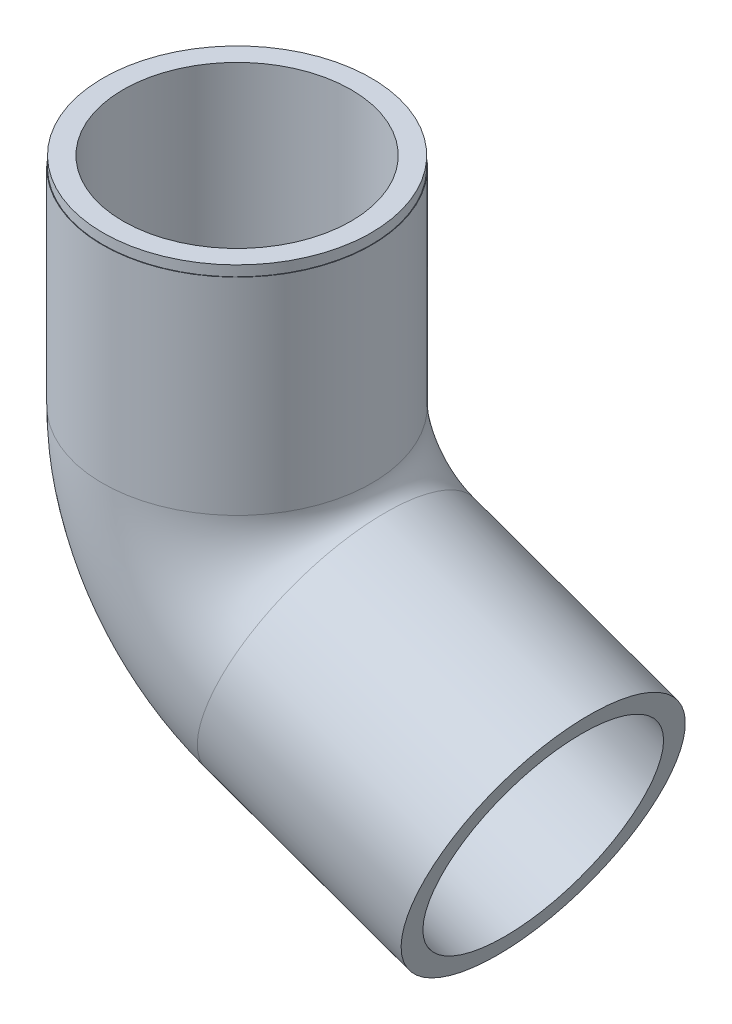
ISO-10303-21;
HEADER;
FILE_DESCRIPTION(('STEP AP214'),'2;1');
FILE_NAME('part.step','',(''),(''),'','','');
FILE_SCHEMA(('AUTOMOTIVE_DESIGN { 1 0 10303 214 1 1 1 1 }'));
ENDSEC;
DATA;
#1=APPLICATION_CONTEXT('core data for automotive mechanical design processes');
#2=APPLICATION_PROTOCOL_DEFINITION('international standard','automotive_design',2000,#1);
#3=PRODUCT_CONTEXT('',#1,'mechanical');
#4=PRODUCT('Part','Part','',(#3));
#5=PRODUCT_RELATED_PRODUCT_CATEGORY('part','',(#4));
#6=PRODUCT_DEFINITION_FORMATION('','',#4);
#7=PRODUCT_DEFINITION_CONTEXT('part definition',#1,'design');
#8=PRODUCT_DEFINITION('design','',#6,#7);
#9=PRODUCT_DEFINITION_SHAPE('','',#8);
#10=(LENGTH_UNIT() NAMED_UNIT(*) SI_UNIT(.MILLI.,.METRE.));
#11=(NAMED_UNIT(*) PLANE_ANGLE_UNIT() SI_UNIT($,.RADIAN.));
#12=(NAMED_UNIT(*) SI_UNIT($,.STERADIAN.) SOLID_ANGLE_UNIT());
#13=UNCERTAINTY_MEASURE_WITH_UNIT(LENGTH_MEASURE(1.E-05),#10,'distance_accuracy_value','');
#14=(GEOMETRIC_REPRESENTATION_CONTEXT(3) GLOBAL_UNCERTAINTY_ASSIGNED_CONTEXT((#13)) GLOBAL_UNIT_ASSIGNED_CONTEXT((#10,
#11,#12)) REPRESENTATION_CONTEXT('',''));
#15=CARTESIAN_POINT('',(0.,0.,0.));
#16=DIRECTION('',(0.,0.,1.));
#17=DIRECTION('',(1.,0.,0.));
#18=AXIS2_PLACEMENT_3D('',#15,#16,#17);
#19=CARTESIAN_POINT('',(0.,-1.,0.));
#20=DIRECTION('',(0.,1.,0.));
#21=DIRECTION('',(0.,0.,1.));
#22=AXIS2_PLACEMENT_3D('',#19,#20,#21);
#23=CYLINDRICAL_SURFACE('',#22,13.);
#24=CARTESIAN_POINT('',(0.,-1.,0.));
#25=DIRECTION('',(0.,1.,0.));
#26=DIRECTION('',(0.,0.,1.));
#27=AXIS2_PLACEMENT_3D('',#24,#25,#26);
#28=CIRCLE('',#27,13.);
#29=CARTESIAN_POINT('',(0.,-1.,13.));
#30=VERTEX_POINT('',#29);
#31=EDGE_CURVE('E65',#30,#30,#28,.T.);
#32=ORIENTED_EDGE('',*,*,#31,.T.);
#33=EDGE_LOOP('',(#32));
#34=FACE_BOUND('',#33,.T.);
#35=CARTESIAN_POINT('',(0.,0.,0.));
#36=DIRECTION('',(0.,1.,0.));
#37=DIRECTION('',(0.,0.,1.));
#38=AXIS2_PLACEMENT_3D('',#35,#36,#37);
#39=CIRCLE('',#38,13.);
#40=CARTESIAN_POINT('',(0.,0.,13.));
#41=VERTEX_POINT('',#40);
#42=EDGE_CURVE('E11',#41,#41,#39,.T.);
#43=ORIENTED_EDGE('',*,*,#42,.F.);
#44=EDGE_LOOP('',(#43));
#45=FACE_BOUND('',#44,.T.);
#46=ADVANCED_FACE('F53',(#34,#45),#23,.T.);
#47=CARTESIAN_POINT('',(0.,0.,0.));
#48=DIRECTION('',(0.,1.,0.));
#49=DIRECTION('',(0.,0.,1.));
#50=AXIS2_PLACEMENT_3D('',#47,#48,#49);
#51=PLANE('',#50);
#52=CARTESIAN_POINT('',(0.,0.,0.));
#53=DIRECTION('',(0.,1.,0.));
#54=DIRECTION('',(0.,0.,1.));
#55=AXIS2_PLACEMENT_3D('',#52,#53,#54);
#56=CIRCLE('',#55,11.05);
#57=CARTESIAN_POINT('',(0.,0.,11.05));
#58=VERTEX_POINT('',#57);
#59=EDGE_CURVE('E60',#58,#58,#56,.T.);
#60=ORIENTED_EDGE('',*,*,#59,.F.);
#61=EDGE_LOOP('',(#60));
#62=FACE_BOUND('',#61,.T.);
#63=ORIENTED_EDGE('',*,*,#42,.T.);
#64=EDGE_LOOP('',(#63));
#65=FACE_BOUND('',#64,.T.);
#66=ADVANCED_FACE('F106',(#62,#65),#51,.T.);
#67=CARTESIAN_POINT('',(0.,-1.,0.));
#68=DIRECTION('',(0.,1.,0.));
#69=DIRECTION('',(0.,0.,1.));
#70=AXIS2_PLACEMENT_3D('',#67,#68,#69);
#71=CYLINDRICAL_SURFACE('',#70,11.05);
#72=ORIENTED_EDGE('',*,*,#59,.T.);
#73=EDGE_LOOP('',(#72));
#74=FACE_BOUND('',#73,.T.);
#75=CARTESIAN_POINT('',(0.,-21.,0.));
#76=DIRECTION('',(0.,1.,0.));
#77=DIRECTION('',(-1.,0.,0.));
#78=AXIS2_PLACEMENT_3D('',#75,#76,#77);
#79=CIRCLE('',#78,11.05);
#80=CARTESIAN_POINT('',(-11.05,-21.,0.));
#81=VERTEX_POINT('',#80);
#82=EDGE_CURVE('E96',#81,#81,#79,.T.);
#83=ORIENTED_EDGE('',*,*,#82,.F.);
#84=EDGE_LOOP('',(#83));
#85=FACE_BOUND('',#84,.T.);
#86=ADVANCED_FACE('F103',(#74,#85),#71,.F.);
#87=CARTESIAN_POINT('',(0.,-1.,0.));
#88=DIRECTION('',(0.,1.,0.));
#89=DIRECTION('',(-1.,0.,0.));
#90=AXIS2_PLACEMENT_3D('',#87,#88,#89);
#91=PLANE('',#90);
#92=ORIENTED_EDGE('',*,*,#31,.F.);
#93=EDGE_LOOP('',(#92));
#94=FACE_BOUND('',#93,.T.);
#95=CARTESIAN_POINT('',(0.,-1.,0.));
#96=DIRECTION('',(0.,1.,0.));
#97=DIRECTION('',(-1.,0.,0.));
#98=AXIS2_PLACEMENT_3D('',#95,#96,#97);
#99=CIRCLE('',#98,13.05);
#100=CARTESIAN_POINT('',(-13.05,-0.999999999999995,0.));
#101=VERTEX_POINT('',#100);
#102=EDGE_CURVE('E77',#101,#101,#99,.T.);
#103=ORIENTED_EDGE('',*,*,#102,.T.);
#104=EDGE_LOOP('',(#103));
#105=FACE_BOUND('',#104,.T.);
#106=ADVANCED_FACE('F105',(#94,#105),#91,.T.);
#107=CARTESIAN_POINT('',(29.6774273443593,-42.2267078594645,0.));
#108=DIRECTION('',(-0.940880768954225,0.338737920245293,0.));
#109=DIRECTION('',(-0.338737920245293,-0.940880768954225,0.));
#110=AXIS2_PLACEMENT_3D('',#107,#108,#109);
#111=PLANE('',#110);
#112=CARTESIAN_POINT('',(29.6774273443593,-42.2267078594645,0.));
#113=DIRECTION('',(-0.940880768954225,0.338737920245293,0.));
#114=DIRECTION('',(-0.338737920245293,-0.940880768954225,0.));
#115=AXIS2_PLACEMENT_3D('',#112,#113,#114);
#116=CIRCLE('',#115,11.05);
#117=CARTESIAN_POINT('',(25.9343733256489,-52.6234403564087,0.));
#118=VERTEX_POINT('',#117);
#119=EDGE_CURVE('E82',#118,#118,#116,.T.);
#120=ORIENTED_EDGE('',*,*,#119,.T.);
#121=EDGE_LOOP('',(#120));
#122=FACE_BOUND('',#121,.T.);
#123=CARTESIAN_POINT('',(29.6774273443593,-42.2267078594645,0.));
#124=DIRECTION('',(-0.940880768954225,0.338737920245293,0.));
#125=DIRECTION('',(-0.338737920245293,-0.940880768954225,0.));
#126=AXIS2_PLACEMENT_3D('',#123,#124,#125);
#127=CIRCLE('',#126,13.05);
#128=CARTESIAN_POINT('',(25.2568974851583,-54.5052018943172,0.));
#129=VERTEX_POINT('',#128);
#130=EDGE_CURVE('E71',#129,#129,#127,.T.);
#131=ORIENTED_EDGE('',*,*,#130,.F.);
#132=EDGE_LOOP('',(#131));
#133=FACE_BOUND('',#132,.T.);
#134=ADVANCED_FACE('F113',(#122,#133),#111,.F.);
#135=CARTESIAN_POINT('',(0.,-1.,0.));
#136=DIRECTION('',(0.,-1.,0.));
#137=DIRECTION('',(1.,0.,0.));
#138=AXIS2_PLACEMENT_3D('',#135,#136,#137);
#139=CYLINDRICAL_SURFACE('',#138,13.05);
#140=CARTESIAN_POINT('',(0.,-21.,0.));
#141=DIRECTION('',(0.,-1.,0.));
#142=DIRECTION('',(1.,0.,0.));
#143=AXIS2_PLACEMENT_3D('',#140,#141,#142);
#144=CIRCLE('',#143,13.05);
#145=CARTESIAN_POINT('',(-13.05,-21.,0.));
#146=VERTEX_POINT('',#145);
#147=EDGE_CURVE('E81',#146,#146,#144,.F.);
#148=ORIENTED_EDGE('',*,*,#147,.T.);
#149=EDGE_LOOP('',(#148));
#150=FACE_BOUND('',#149,.T.);
#151=ORIENTED_EDGE('',*,*,#102,.F.);
#152=EDGE_LOOP('',(#151));
#153=FACE_BOUND('',#152,.T.);
#154=ADVANCED_FACE('F131',(#150,#153),#139,.T.);
#155=CARTESIAN_POINT('',(15.,-21.,0.));
#156=DIRECTION('',(0.,0.,1.));
#157=DIRECTION('',(1.,0.,0.));
#158=AXIS2_PLACEMENT_3D('',#155,#156,#157);
#159=TOROIDAL_SURFACE('',#158,15.,13.05);
#160=CARTESIAN_POINT('',(9.91893119632068,-35.1132115343134,0.));
#161=DIRECTION('',(-0.940880768954227,0.338737920245288,0.));
#162=DIRECTION('',(-0.338737920245288,-0.940880768954227,0.));
#163=AXIS2_PLACEMENT_3D('',#160,#161,#162);
#164=CIRCLE('',#163,13.05);
#165=CARTESIAN_POINT('',(5.49840133711967,-47.3917055691661,0.));
#166=VERTEX_POINT('',#165);
#167=EDGE_CURVE('E76',#166,#166,#164,.T.);
#168=CARTESIAN_POINT('',(15.,-21.,0.));
#169=DIRECTION('',(0.,0.,1.));
#170=DIRECTION('',(1.,0.,0.));
#171=AXIS2_PLACEMENT_3D('',#168,#169,#170);
#172=CIRCLE('',#171,28.05);
#173=EDGE_CURVE('',#146,#166,#172,.T.);
#174=ORIENTED_EDGE('',*,*,#147,.F.);
#175=ORIENTED_EDGE('',*,*,#167,.T.);
#176=ORIENTED_EDGE('',*,*,#173,.T.);
#177=ORIENTED_EDGE('',*,*,#173,.F.);
#178=EDGE_LOOP('',(#174,#176,#175,#177));
#179=FACE_BOUND('',#178,.T.);
#180=ADVANCED_FACE('F120',(#179),#159,.T.);
#181=CARTESIAN_POINT('',(9.91893119632063,-35.1132115343134,0.));
#182=DIRECTION('',(0.940880768954225,-0.338737920245292,0.));
#183=DIRECTION('',(0.338737920245292,0.940880768954225,0.));
#184=AXIS2_PLACEMENT_3D('',#181,#182,#183);
#185=CYLINDRICAL_SURFACE('',#184,13.05);
#186=ORIENTED_EDGE('',*,*,#130,.T.);
#187=EDGE_LOOP('',(#186));
#188=FACE_BOUND('',#187,.T.);
#189=ORIENTED_EDGE('',*,*,#167,.F.);
#190=EDGE_LOOP('',(#189));
#191=FACE_BOUND('',#190,.T.);
#192=ADVANCED_FACE('F108',(#188,#191),#185,.T.);
#193=CARTESIAN_POINT('',(15.,-21.,0.));
#194=DIRECTION('',(0.,0.,1.));
#195=DIRECTION('',(1.,0.,0.));
#196=AXIS2_PLACEMENT_3D('',#193,#194,#195);
#197=TOROIDAL_SURFACE('',#196,15.,11.05);
#198=CARTESIAN_POINT('',(9.91893119632064,-35.1132115343134,0.));
#199=DIRECTION('',(-0.940880768954225,0.338737920245293,0.));
#200=DIRECTION('',(-0.338737920245293,-0.940880768954225,0.));
#201=AXIS2_PLACEMENT_3D('',#198,#199,#200);
#202=CIRCLE('',#201,11.05);
#203=CARTESIAN_POINT('',(6.17587717761016,-45.5099440312576,0.));
#204=VERTEX_POINT('',#203);
#205=EDGE_CURVE('E92',#204,#204,#202,.T.);
#206=CARTESIAN_POINT('',(15.,-21.,0.));
#207=DIRECTION('',(0.,0.,1.));
#208=DIRECTION('',(1.,0.,0.));
#209=AXIS2_PLACEMENT_3D('',#206,#207,#208);
#210=CIRCLE('',#209,26.05);
#211=EDGE_CURVE('',#81,#204,#210,.T.);
#212=ORIENTED_EDGE('',*,*,#82,.T.);
#213=ORIENTED_EDGE('',*,*,#205,.F.);
#214=ORIENTED_EDGE('',*,*,#211,.T.);
#215=ORIENTED_EDGE('',*,*,#211,.F.);
#216=EDGE_LOOP('',(#212,#214,#213,#215));
#217=FACE_BOUND('',#216,.T.);
#218=ADVANCED_FACE('F101',(#217),#197,.F.);
#219=CARTESIAN_POINT('',(9.91893119632063,-35.1132115343134,0.));
#220=DIRECTION('',(0.940880768954225,-0.338737920245292,0.));
#221=DIRECTION('',(0.338737920245292,0.940880768954225,0.));
#222=AXIS2_PLACEMENT_3D('',#219,#220,#221);
#223=CYLINDRICAL_SURFACE('',#222,11.05);
#224=ORIENTED_EDGE('',*,*,#119,.F.);
#225=EDGE_LOOP('',(#224));
#226=FACE_BOUND('',#225,.T.);
#227=ORIENTED_EDGE('',*,*,#205,.T.);
#228=EDGE_LOOP('',(#227));
#229=FACE_BOUND('',#228,.T.);
#230=ADVANCED_FACE('F116',(#226,#229),#223,.F.);
#231=CLOSED_SHELL('',(#46,#66,#86,#106,#134,#154,#180,#192,#218,#230));
#232=MANIFOLD_SOLID_BREP('B2',#231);
#233=ADVANCED_BREP_SHAPE_REPRESENTATION('',(#18,#232),#14);
#234=SHAPE_DEFINITION_REPRESENTATION(#9,#233);
ENDSEC;
END-ISO-10303-21;
